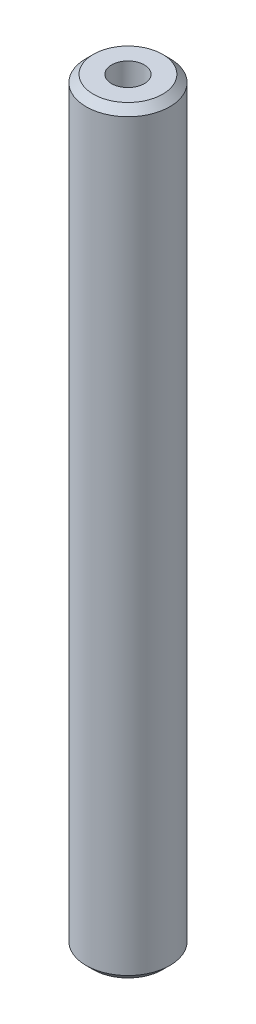
ISO-10303-21;
HEADER;
FILE_DESCRIPTION(('STEP AP214'),'2;1');
FILE_NAME('part.step','',(''),(''),'','','');
FILE_SCHEMA(('AUTOMOTIVE_DESIGN { 1 0 10303 214 1 1 1 1 }'));
ENDSEC;
DATA;
#1=APPLICATION_CONTEXT('core data for automotive mechanical design processes');
#2=APPLICATION_PROTOCOL_DEFINITION('international standard','automotive_design',2000,#1);
#3=PRODUCT_CONTEXT('',#1,'mechanical');
#4=PRODUCT('Part','Part','',(#3));
#5=PRODUCT_RELATED_PRODUCT_CATEGORY('part','',(#4));
#6=PRODUCT_DEFINITION_FORMATION('','',#4);
#7=PRODUCT_DEFINITION_CONTEXT('part definition',#1,'design');
#8=PRODUCT_DEFINITION('design','',#6,#7);
#9=PRODUCT_DEFINITION_SHAPE('','',#8);
#10=(LENGTH_UNIT() NAMED_UNIT(*) SI_UNIT(.MILLI.,.METRE.));
#11=(NAMED_UNIT(*) PLANE_ANGLE_UNIT() SI_UNIT($,.RADIAN.));
#12=(NAMED_UNIT(*) SI_UNIT($,.STERADIAN.) SOLID_ANGLE_UNIT());
#13=UNCERTAINTY_MEASURE_WITH_UNIT(LENGTH_MEASURE(1.E-05),#10,'distance_accuracy_value','');
#14=(GEOMETRIC_REPRESENTATION_CONTEXT(3) GLOBAL_UNCERTAINTY_ASSIGNED_CONTEXT((#13)) GLOBAL_UNIT_ASSIGNED_CONTEXT((#10,
#11,#12)) REPRESENTATION_CONTEXT('',''));
#15=CARTESIAN_POINT('',(0.,0.,0.));
#16=DIRECTION('',(0.,0.,1.));
#17=DIRECTION('',(1.,0.,0.));
#18=AXIS2_PLACEMENT_3D('',#15,#16,#17);
#19=CARTESIAN_POINT('',(0.,226.520057946772,0.));
#20=DIRECTION('',(0.,-1.,0.));
#21=DIRECTION('',(0.,0.,-1.));
#22=AXIS2_PLACEMENT_3D('',#19,#20,#21);
#23=CYLINDRICAL_SURFACE('',#22,12.5);
#24=CARTESIAN_POINT('',(0.,224.361423567234,0.));
#25=DIRECTION('',(0.,1.,0.));
#26=DIRECTION('',(0.,0.,1.));
#27=AXIS2_PLACEMENT_3D('',#24,#25,#26);
#28=CIRCLE('',#27,12.5);
#29=CARTESIAN_POINT('',(0.,224.361423567234,12.5));
#30=VERTEX_POINT('',#29);
#31=EDGE_CURVE('E50',#30,#30,#28,.F.);
#32=ORIENTED_EDGE('',*,*,#31,.T.);
#33=EDGE_LOOP('',(#32));
#34=FACE_BOUND('',#33,.T.);
#35=CARTESIAN_POINT('',(0.,2.15863437953817,0.));
#36=DIRECTION('',(0.,1.,0.));
#37=DIRECTION('',(0.,0.,1.));
#38=AXIS2_PLACEMENT_3D('',#35,#36,#37);
#39=CIRCLE('',#38,12.5);
#40=CARTESIAN_POINT('',(0.,2.15863437953817,12.5));
#41=VERTEX_POINT('',#40);
#42=EDGE_CURVE('E51',#41,#41,#39,.T.);
#43=ORIENTED_EDGE('',*,*,#42,.T.);
#44=EDGE_LOOP('',(#43));
#45=FACE_BOUND('',#44,.T.);
#46=ADVANCED_FACE('F39',(#34,#45),#23,.T.);
#47=CARTESIAN_POINT('',(0.,226.520057946772,0.));
#48=DIRECTION('',(0.,1.,0.));
#49=DIRECTION('',(0.,0.,1.));
#50=AXIS2_PLACEMENT_3D('',#47,#48,#49);
#51=PLANE('',#50);
#52=CARTESIAN_POINT('',(0.,226.520057946772,0.));
#53=DIRECTION('',(0.,1.,0.));
#54=DIRECTION('',(0.,0.,1.));
#55=AXIS2_PLACEMENT_3D('',#52,#53,#54);
#56=CIRCLE('',#55,10.3413656204618);
#57=CARTESIAN_POINT('',(0.,226.520057946772,10.3413656204618));
#58=VERTEX_POINT('',#57);
#59=EDGE_CURVE('E54',#58,#58,#56,.T.);
#60=ORIENTED_EDGE('',*,*,#59,.T.);
#61=EDGE_LOOP('',(#60));
#62=FACE_BOUND('',#61,.T.);
#63=CARTESIAN_POINT('',(0.,226.520057946772,0.));
#64=DIRECTION('',(0.,1.,0.));
#65=DIRECTION('',(0.,0.,1.));
#66=AXIS2_PLACEMENT_3D('',#63,#64,#65);
#67=CIRCLE('',#66,4.88539470826633);
#68=CARTESIAN_POINT('',(0.,226.520057946772,4.88539470826633));
#69=VERTEX_POINT('',#68);
#70=EDGE_CURVE('E58',#69,#69,#67,.T.);
#71=ORIENTED_EDGE('',*,*,#70,.F.);
#72=EDGE_LOOP('',(#71));
#73=FACE_BOUND('',#72,.T.);
#74=ADVANCED_FACE('F69',(#62,#73),#51,.T.);
#75=CARTESIAN_POINT('',(0.,0.,0.));
#76=DIRECTION('',(0.,1.,0.));
#77=DIRECTION('',(0.,0.,1.));
#78=AXIS2_PLACEMENT_3D('',#75,#76,#77);
#79=PLANE('',#78);
#80=CARTESIAN_POINT('',(0.,0.,0.));
#81=DIRECTION('',(0.,1.,0.));
#82=DIRECTION('',(0.,0.,1.));
#83=AXIS2_PLACEMENT_3D('',#80,#81,#82);
#84=CIRCLE('',#83,10.3413656204618);
#85=CARTESIAN_POINT('',(0.,0.,10.3413656204618));
#86=VERTEX_POINT('',#85);
#87=EDGE_CURVE('E10',#86,#86,#84,.F.);
#88=ORIENTED_EDGE('',*,*,#87,.T.);
#89=EDGE_LOOP('',(#88));
#90=FACE_BOUND('',#89,.T.);
#91=CARTESIAN_POINT('',(0.,0.,0.));
#92=DIRECTION('',(0.,1.,0.));
#93=DIRECTION('',(0.,0.,1.));
#94=AXIS2_PLACEMENT_3D('',#91,#92,#93);
#95=CIRCLE('',#94,4.88539470826633);
#96=CARTESIAN_POINT('',(0.,0.,4.88539470826633));
#97=VERTEX_POINT('',#96);
#98=EDGE_CURVE('E63',#97,#97,#95,.T.);
#99=ORIENTED_EDGE('',*,*,#98,.T.);
#100=EDGE_LOOP('',(#99));
#101=FACE_BOUND('',#100,.T.);
#102=ADVANCED_FACE('F75',(#90,#101),#79,.F.);
#103=CARTESIAN_POINT('',(0.,226.520057946772,0.));
#104=DIRECTION('',(0.,-1.,0.));
#105=DIRECTION('',(0.,0.,-1.));
#106=AXIS2_PLACEMENT_3D('',#103,#104,#105);
#107=CYLINDRICAL_SURFACE('',#106,4.88539470826633);
#108=ORIENTED_EDGE('',*,*,#70,.T.);
#109=EDGE_LOOP('',(#108));
#110=FACE_BOUND('',#109,.T.);
#111=ORIENTED_EDGE('',*,*,#98,.F.);
#112=EDGE_LOOP('',(#111));
#113=FACE_BOUND('',#112,.T.);
#114=ADVANCED_FACE('F70',(#110,#113),#107,.F.);
#115=CARTESIAN_POINT('',(0.,226.520057946772,0.));
#116=DIRECTION('',(0.,-1.,0.));
#117=DIRECTION('',(0.,0.,-1.));
#118=AXIS2_PLACEMENT_3D('',#115,#116,#117);
#119=CONICAL_SURFACE('',#118,10.3413656204618,0.785398163397452);
#120=ORIENTED_EDGE('',*,*,#31,.F.);
#121=EDGE_LOOP('',(#120));
#122=FACE_BOUND('',#121,.T.);
#123=ORIENTED_EDGE('',*,*,#59,.F.);
#124=EDGE_LOOP('',(#123));
#125=FACE_BOUND('',#124,.T.);
#126=ADVANCED_FACE('F81',(#122,#125),#119,.T.);
#127=CARTESIAN_POINT('',(0.,2.15863437953817,0.));
#128=DIRECTION('',(0.,1.,0.));
#129=DIRECTION('',(0.,0.,1.));
#130=AXIS2_PLACEMENT_3D('',#127,#128,#129);
#131=CONICAL_SURFACE('',#130,12.5,0.785398163397446);
#132=ORIENTED_EDGE('',*,*,#87,.F.);
#133=EDGE_LOOP('',(#132));
#134=FACE_BOUND('',#133,.T.);
#135=ORIENTED_EDGE('',*,*,#42,.F.);
#136=EDGE_LOOP('',(#135));
#137=FACE_BOUND('',#136,.T.);
#138=ADVANCED_FACE('F45',(#134,#137),#131,.T.);
#139=CLOSED_SHELL('',(#46,#74,#102,#114,#126,#138));
#140=MANIFOLD_SOLID_BREP('B2',#139);
#141=ADVANCED_BREP_SHAPE_REPRESENTATION('',(#18,#140),#14);
#142=SHAPE_DEFINITION_REPRESENTATION(#9,#141);
ENDSEC;
END-ISO-10303-21;
